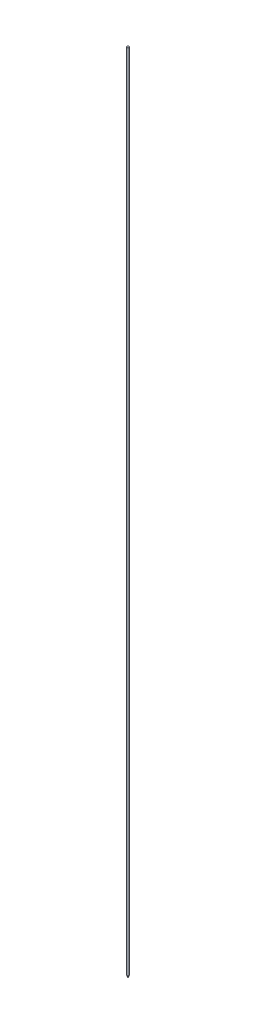
ISO-10303-21;
HEADER;
FILE_DESCRIPTION(('STEP AP214'),'2;1');
FILE_NAME('part.step','',(''),(''),'','','');
FILE_SCHEMA(('AUTOMOTIVE_DESIGN { 1 0 10303 214 1 1 1 1 }'));
ENDSEC;
DATA;
#1=APPLICATION_CONTEXT('core data for automotive mechanical design processes');
#2=APPLICATION_PROTOCOL_DEFINITION('international standard','automotive_design',2000,#1);
#3=PRODUCT_CONTEXT('',#1,'mechanical');
#4=PRODUCT('Part','Part','',(#3));
#5=PRODUCT_RELATED_PRODUCT_CATEGORY('part','',(#4));
#6=PRODUCT_DEFINITION_FORMATION('','',#4);
#7=PRODUCT_DEFINITION_CONTEXT('part definition',#1,'design');
#8=PRODUCT_DEFINITION('design','',#6,#7);
#9=PRODUCT_DEFINITION_SHAPE('','',#8);
#10=(LENGTH_UNIT() NAMED_UNIT(*) SI_UNIT(.MILLI.,.METRE.));
#11=(NAMED_UNIT(*) PLANE_ANGLE_UNIT() SI_UNIT($,.RADIAN.));
#12=(NAMED_UNIT(*) SI_UNIT($,.STERADIAN.) SOLID_ANGLE_UNIT());
#13=UNCERTAINTY_MEASURE_WITH_UNIT(LENGTH_MEASURE(1.E-05),#10,'distance_accuracy_value','');
#14=(GEOMETRIC_REPRESENTATION_CONTEXT(3) GLOBAL_UNCERTAINTY_ASSIGNED_CONTEXT((#13)) GLOBAL_UNIT_ASSIGNED_CONTEXT((#10,
#11,#12)) REPRESENTATION_CONTEXT('',''));
#15=CARTESIAN_POINT('',(0.,0.,0.));
#16=DIRECTION('',(0.,0.,1.));
#17=DIRECTION('',(1.,0.,0.));
#18=AXIS2_PLACEMENT_3D('',#15,#16,#17);
#19=CARTESIAN_POINT('',(1.22739034965834E-13,138.167565896088,0.));
#20=DIRECTION('',(0.,-1.,0.));
#21=DIRECTION('',(0.,0.,-1.));
#22=AXIS2_PLACEMENT_3D('',#19,#20,#21);
#23=PLANE('',#22);
#24=CARTESIAN_POINT('',(0.,138.167565896088,0.));
#25=DIRECTION('',(0.,1.,0.));
#26=DIRECTION('',(0.,0.,1.));
#27=AXIS2_PLACEMENT_3D('',#24,#25,#26);
#28=CIRCLE('',#27,1.58750000000011);
#29=CARTESIAN_POINT('',(0.,138.167565896088,1.58750000000011));
#30=VERTEX_POINT('',#29);
#31=EDGE_CURVE('E63',#30,#30,#28,.T.);
#32=ORIENTED_EDGE('',*,*,#31,.T.);
#33=EDGE_LOOP('',(#32));
#34=FACE_BOUND('',#33,.T.);
#35=ADVANCED_FACE('F35',(#34),#23,.F.);
#36=CARTESIAN_POINT('',(0.,11.2837513484358,0.));
#37=DIRECTION('',(0.,1.,0.));
#38=DIRECTION('',(0.,0.,1.));
#39=AXIS2_PLACEMENT_3D('',#36,#37,#38);
#40=CYLINDRICAL_SURFACE('',#39,1.58750000000005);
#41=CARTESIAN_POINT('',(0.,-987.04717267796,0.));
#42=DIRECTION('',(0.,-1.,0.));
#43=DIRECTION('',(0.,0.,-1.));
#44=AXIS2_PLACEMENT_3D('',#41,#42,#43);
#45=CIRCLE('',#44,1.58750000000005);
#46=CARTESIAN_POINT('',(0.,-987.04717267796,-1.58750000000005));
#47=VERTEX_POINT('',#46);
#48=EDGE_CURVE('E42',#47,#47,#45,.F.);
#49=ORIENTED_EDGE('',*,*,#48,.T.);
#50=EDGE_LOOP('',(#49));
#51=FACE_BOUND('',#50,.T.);
#52=ORIENTED_EDGE('',*,*,#31,.F.);
#53=EDGE_LOOP('',(#52));
#54=FACE_BOUND('',#53,.T.);
#55=ADVANCED_FACE('F47',(#51,#54),#40,.T.);
#56=CARTESIAN_POINT('',(0.,-990.956527655193,0.));
#57=DIRECTION('',(0.,1.,0.));
#58=DIRECTION('',(0.,0.,1.));
#59=AXIS2_PLACEMENT_3D('',#56,#57,#58);
#60=CONICAL_SURFACE('',#59,1.6549627903418E-13,0.404898933170157);
#61=CARTESIAN_POINT('',(0.,-987.441098545553,0.));
#62=DIRECTION('',(0.,-1.,0.));
#63=DIRECTION('',(0.,0.,-1.));
#64=AXIS2_PLACEMENT_3D('',#61,#62,#63);
#65=CIRCLE('',#64,1.50664221469866);
#66=CARTESIAN_POINT('',(0.,-987.441098545553,-1.50664221469866));
#67=VERTEX_POINT('',#66);
#68=EDGE_CURVE('E12',#67,#67,#65,.T.);
#69=ORIENTED_EDGE('',*,*,#68,.T.);
#70=EDGE_LOOP('',(#69));
#71=FACE_BOUND('',#70,.T.);
#72=CARTESIAN_POINT('',(1.22731685925359E-13,-990.956527655193,0.));
#73=VERTEX_POINT('',#72);
#74=VERTEX_LOOP('',#73);
#75=FACE_BOUND('',#74,.T.);
#76=ADVANCED_FACE('F45',(#71,#75),#60,.T.);
#77=CARTESIAN_POINT('',(0.,-987.04717267796,0.));
#78=DIRECTION('',(0.,-1.,0.));
#79=DIRECTION('',(0.,0.,-1.));
#80=AXIS2_PLACEMENT_3D('',#77,#78,#79);
#81=DEGENERATE_TOROIDAL_SURFACE('',#80,0.587500000000053,1.,.T.);
#82=ORIENTED_EDGE('',*,*,#68,.F.);
#83=EDGE_LOOP('',(#82));
#84=FACE_BOUND('',#83,.T.);
#85=ORIENTED_EDGE('',*,*,#48,.F.);
#86=EDGE_LOOP('',(#85));
#87=FACE_BOUND('',#86,.T.);
#88=ADVANCED_FACE('F37',(#84,#87),#81,.T.);
#89=CLOSED_SHELL('',(#35,#55,#76,#88));
#90=MANIFOLD_SOLID_BREP('B2',#89);
#91=ADVANCED_BREP_SHAPE_REPRESENTATION('',(#18,#90),#14);
#92=SHAPE_DEFINITION_REPRESENTATION(#9,#91);
ENDSEC;
END-ISO-10303-21;
